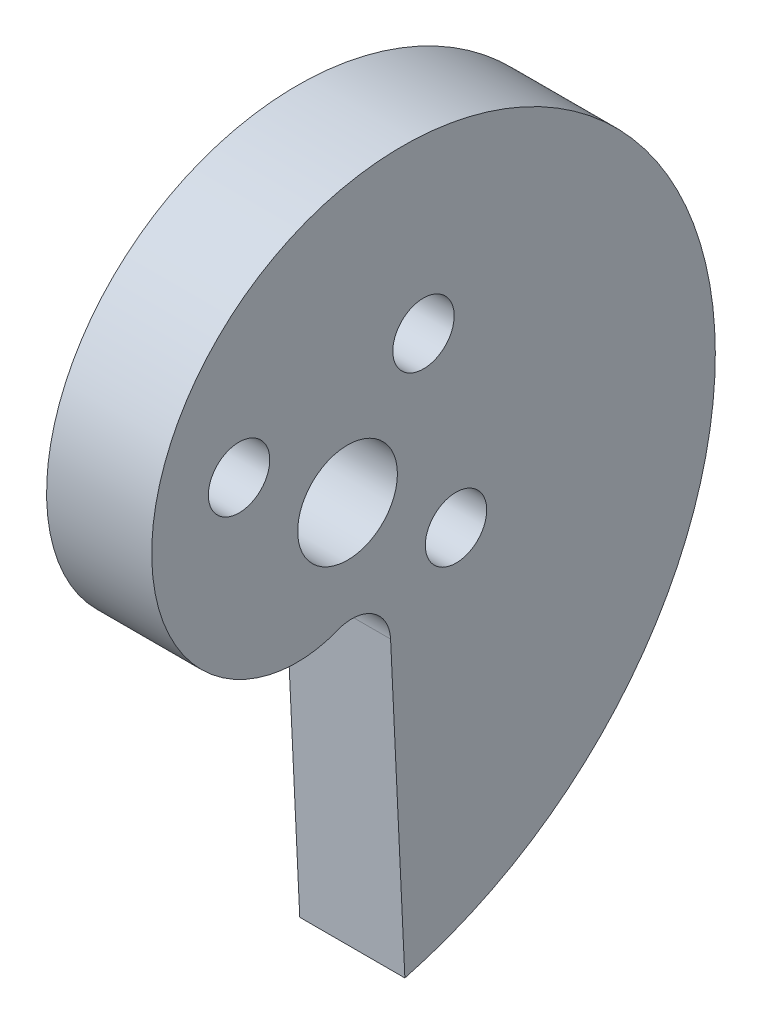
ISO-10303-21;
HEADER;
FILE_DESCRIPTION(('STEP AP214'),'2;1');
FILE_NAME('part.step','',(''),(''),'','','');
FILE_SCHEMA(('AUTOMOTIVE_DESIGN { 1 0 10303 214 1 1 1 1 }'));
ENDSEC;
DATA;
#1=APPLICATION_CONTEXT('core data for automotive mechanical design processes');
#2=APPLICATION_PROTOCOL_DEFINITION('international standard','automotive_design',2000,#1);
#3=PRODUCT_CONTEXT('',#1,'mechanical');
#4=PRODUCT('Part','Part','',(#3));
#5=PRODUCT_RELATED_PRODUCT_CATEGORY('part','',(#4));
#6=PRODUCT_DEFINITION_FORMATION('','',#4);
#7=PRODUCT_DEFINITION_CONTEXT('part definition',#1,'design');
#8=PRODUCT_DEFINITION('design','',#6,#7);
#9=PRODUCT_DEFINITION_SHAPE('','',#8);
#10=(LENGTH_UNIT() NAMED_UNIT(*) SI_UNIT(.MILLI.,.METRE.));
#11=(NAMED_UNIT(*) PLANE_ANGLE_UNIT() SI_UNIT($,.RADIAN.));
#12=(NAMED_UNIT(*) SI_UNIT($,.STERADIAN.) SOLID_ANGLE_UNIT());
#13=UNCERTAINTY_MEASURE_WITH_UNIT(LENGTH_MEASURE(1.E-05),#10,'distance_accuracy_value','');
#14=(GEOMETRIC_REPRESENTATION_CONTEXT(3) GLOBAL_UNCERTAINTY_ASSIGNED_CONTEXT((#13)) GLOBAL_UNIT_ASSIGNED_CONTEXT((#10,
#11,#12)) REPRESENTATION_CONTEXT('',''));
#15=CARTESIAN_POINT('',(0.,0.,0.));
#16=DIRECTION('',(0.,0.,1.));
#17=DIRECTION('',(1.,0.,0.));
#18=AXIS2_PLACEMENT_3D('',#15,#16,#17);
#19=CARTESIAN_POINT('',(6.35,16.3980040897592,0.208936694079273));
#20=DIRECTION('',(1.,0.,0.));
#21=DIRECTION('',(0.,0.,-1.));
#22=AXIS2_PLACEMENT_3D('',#19,#20,#21);
#23=PLANE('',#22);
#24=CARTESIAN_POINT('',(6.35,6.55321635431194,-4.58861149080837));
#25=DIRECTION('',(-1.,0.,0.));
#26=DIRECTION('',(0.,0.,1.));
#27=AXIS2_PLACEMENT_3D('',#24,#25,#26);
#28=CIRCLE('',#27,1.8542);
#29=CARTESIAN_POINT('',(6.35,6.55321635431194,-2.73441149080837));
#30=VERTEX_POINT('',#29);
#31=EDGE_CURVE('E151',#30,#30,#28,.T.);
#32=ORIENTED_EDGE('',*,*,#31,.T.);
#33=EDGE_LOOP('',(#32));
#34=FACE_BOUND('',#33,.T.);
#35=CARTESIAN_POINT('',(6.35,4.58861149080839,6.55321635431194));
#36=DIRECTION('',(-1.,0.,0.));
#37=DIRECTION('',(0.,0.,1.));
#38=AXIS2_PLACEMENT_3D('',#35,#36,#37);
#39=CIRCLE('',#38,1.8542);
#40=CARTESIAN_POINT('',(6.35,4.58861149080839,8.40741635431194));
#41=VERTEX_POINT('',#40);
#42=EDGE_CURVE('E155',#41,#41,#39,.T.);
#43=ORIENTED_EDGE('',*,*,#42,.T.);
#44=EDGE_LOOP('',(#43));
#45=FACE_BOUND('',#44,.T.);
#46=CARTESIAN_POINT('',(6.35,-4.58861149080837,-6.55321635431192));
#47=DIRECTION('',(-1.,0.,0.));
#48=DIRECTION('',(0.,0.,1.));
#49=AXIS2_PLACEMENT_3D('',#46,#47,#48);
#50=CIRCLE('',#49,1.8542);
#51=CARTESIAN_POINT('',(6.35,-4.58861149080837,-4.69901635431192));
#52=VERTEX_POINT('',#51);
#53=EDGE_CURVE('E158',#52,#52,#50,.T.);
#54=ORIENTED_EDGE('',*,*,#53,.T.);
#55=EDGE_LOOP('',(#54));
#56=FACE_BOUND('',#55,.T.);
#57=CARTESIAN_POINT('',(6.35,-26.6041786448891,-3.46411616806894));
#58=CARTESIAN_POINT('',(6.35,-26.5960990181453,-3.49393067135354));
#59=CARTESIAN_POINT('',(6.35,-26.5880156349324,-3.52374410868873));
#60=CARTESIAN_POINT('',(6.35,-26.5718488325451,-3.58337111594988));
#61=CARTESIAN_POINT('',(6.35,-26.5637654133707,-3.61318468587584));
#62=CARTESIAN_POINT('',(6.35,-26.5395261439436,-3.70262963202641));
#63=CARTESIAN_POINT('',(6.35,-26.5233815637382,-3.76226420628094));
#64=CARTESIAN_POINT('',(6.35,-26.4906236526863,-3.88140637873935));
#65=CARTESIAN_POINT('',(6.35,-26.4740103112024,-3.94091397402874));
#66=CARTESIAN_POINT('',(6.35,-26.4403815894244,-4.05981460436438));
#67=CARTESIAN_POINT('',(6.35,-26.4233662121929,-4.11920764027957));
#68=CARTESIAN_POINT('',(6.35,-26.3716923994657,-4.29720938115184));
#69=CARTESIAN_POINT('',(6.35,-26.3364072843143,-4.41563707917067));
#70=CARTESIAN_POINT('',(6.35,-26.2641853845529,-4.6519850599258));
#71=CARTESIAN_POINT('',(6.35,-26.2272486119225,-4.76990534633561));
#72=CARTESIAN_POINT('',(6.35,-26.1139444068046,-5.12293103285834));
#73=CARTESIAN_POINT('',(6.35,-26.0350986002427,-5.35724781947172));
#74=CARTESIAN_POINT('',(6.35,-25.8708563849999,-5.8235592949556));
#75=CARTESIAN_POINT('',(6.35,-25.7854600420231,-6.05555400709093));
#76=CARTESIAN_POINT('',(6.35,-25.5195003139906,-6.74780898379338));
#77=CARTESIAN_POINT('',(6.35,-25.3291595386374,-7.20436094526831));
#78=CARTESIAN_POINT('',(6.35,-24.9225212871115,-8.10647878886224));
#79=CARTESIAN_POINT('',(6.35,-24.7061887301483,-8.55202882213988));
#80=CARTESIAN_POINT('',(6.35,-24.2482870811777,-9.42992884621023));
#81=CARTESIAN_POINT('',(6.35,-24.0067199993427,-9.86227988488946));
#82=CARTESIAN_POINT('',(6.35,-23.499035484093,-10.7123263424163));
#83=CARTESIAN_POINT('',(6.35,-23.2329186005125,-11.1300220892049));
#84=CARTESIAN_POINT('',(6.35,-22.7456402479494,-11.847851602567));
#85=CARTESIAN_POINT('',(6.35,-22.5296437628228,-12.1515056315926));
#86=CARTESIAN_POINT('',(6.35,-22.084413352748,-12.7489932481006));
#87=CARTESIAN_POINT('',(6.35,-21.8551785466971,-13.0428261798607));
#88=CARTESIAN_POINT('',(6.35,-21.3838895241104,-13.620035602395));
#89=CARTESIAN_POINT('',(6.35,-21.141834989919,-13.9034118337705));
#90=CARTESIAN_POINT('',(6.35,-20.6453436861472,-14.4590921821359));
#91=CARTESIAN_POINT('',(6.35,-20.3909071208197,-14.7313964816312));
#92=CARTESIAN_POINT('',(6.35,-19.870311136869,-15.2640889646824));
#93=CARTESIAN_POINT('',(6.35,-19.6041625900917,-15.5244877601765));
#94=CARTESIAN_POINT('',(6.35,-19.0603866610495,-16.0329689554833));
#95=CARTESIAN_POINT('',(6.35,-18.7827592318886,-16.2810513049693));
#96=CARTESIAN_POINT('',(6.35,-17.933432481453,-17.0059312611249));
#97=CARTESIAN_POINT('',(6.35,-17.3451183982972,-17.4635361757599));
#98=CARTESIAN_POINT('',(6.35,-16.1647015449857,-18.2976613403723));
#99=CARTESIAN_POINT('',(6.35,-15.5748340735074,-18.6773591195821));
#100=CARTESIAN_POINT('',(6.35,-14.3640301688315,-19.3835613476243));
#101=CARTESIAN_POINT('',(6.35,-13.7430946848625,-19.7100674203402));
#102=CARTESIAN_POINT('',(6.35,-12.4747331278291,-20.3069368781326));
#103=CARTESIAN_POINT('',(6.35,-11.8273052792346,-20.5772964928467));
#104=CARTESIAN_POINT('',(6.35,-10.5107649849682,-21.0586719994844));
#105=CARTESIAN_POINT('',(6.35,-9.84165333182641,-21.2696900575841));
#106=CARTESIAN_POINT('',(6.35,-8.51931603069606,-21.6215571855532));
#107=CARTESIAN_POINT('',(6.35,-7.86685786047716,-21.7652761257472));
#108=CARTESIAN_POINT('',(6.35,-6.88075589921008,-21.9374607449297));
#109=CARTESIAN_POINT('',(6.35,-6.55078378350999,-21.9876263623933));
#110=CARTESIAN_POINT('',(6.35,-5.88895381514913,-22.0733163220885));
#111=CARTESIAN_POINT('',(6.35,-5.55709595067515,-22.1088405724972));
#112=CARTESIAN_POINT('',(6.35,-4.55979382082403,-22.1932365925857));
#113=CARTESIAN_POINT('',(6.35,-3.89228024143644,-22.2199912172447));
#114=CARTESIAN_POINT('',(6.35,-2.89152295014816,-22.2149934639596));
#115=CARTESIAN_POINT('',(6.35,-2.55798556615433,-22.2058023918767));
#116=CARTESIAN_POINT('',(6.35,-1.89167446294591,-22.1722723503277));
#117=CARTESIAN_POINT('',(6.35,-1.55890073697784,-22.1479335153446));
#118=CARTESIAN_POINT('',(6.35,-0.595715786563489,-22.0553379817985));
#119=CARTESIAN_POINT('',(6.35,0.0329519082644807,-21.9672696384117));
#120=CARTESIAN_POINT('',(6.35,0.968090394017084,-21.7940847068843));
#121=CARTESIAN_POINT('',(6.35,1.27852595277456,-21.7295000942686));
#122=CARTESIAN_POINT('',(6.35,1.89622303880414,-21.5866153495594));
#123=CARTESIAN_POINT('',(6.35,2.20348455851135,-21.5083151847848));
#124=CARTESIAN_POINT('',(6.35,3.11949232688065,-21.2529876735919));
#125=CARTESIAN_POINT('',(6.35,3.72272393447467,-21.0554848603221));
#126=CARTESIAN_POINT('',(6.35,4.61211008989112,-20.7191477551366));
#127=CARTESIAN_POINT('',(6.35,4.90602590174425,-20.600340041007));
#128=CARTESIAN_POINT('',(6.35,5.48814338740102,-20.3494332944114));
#129=CARTESIAN_POINT('',(6.35,5.77634502116379,-20.2173341688482));
#130=CARTESIAN_POINT('',(6.35,6.60155511822596,-19.8159032003133));
#131=CARTESIAN_POINT('',(6.35,7.13040589307388,-19.5295564938876));
#132=CARTESIAN_POINT('',(6.35,8.16081793802565,-18.9114937344462));
#133=CARTESIAN_POINT('',(6.35,8.66238000700598,-18.5797790105786));
#134=CARTESIAN_POINT('',(6.35,9.63370323518806,-17.8727976579963));
#135=CARTESIAN_POINT('',(6.35,10.1034706650373,-17.4975396568974));
#136=CARTESIAN_POINT('',(6.35,11.0071094740781,-16.7060538785788));
#137=CARTESIAN_POINT('',(6.35,11.4409836517707,-16.2898293009652));
#138=CARTESIAN_POINT('',(6.35,12.2455901724637,-15.4431512610323));
#139=CARTESIAN_POINT('',(6.35,12.6184856964032,-15.0147506322602));
#140=CARTESIAN_POINT('',(6.35,13.3251088370727,-14.1266556784948));
#141=CARTESIAN_POINT('',(6.35,13.658837644674,-13.6669623056353));
#142=CARTESIAN_POINT('',(6.35,14.1273347711691,-12.9565066966575));
#143=CARTESIAN_POINT('',(6.35,14.2781567865579,-12.7161917146737));
#144=CARTESIAN_POINT('',(6.35,14.5687526701808,-12.2289769415579));
#145=CARTESIAN_POINT('',(6.35,14.7085275622432,-11.982077763481));
#146=CARTESIAN_POINT('',(6.35,14.976662087067,-11.4822081934086));
#147=CARTESIAN_POINT('',(6.35,15.1050233906383,-11.2292386969412));
#148=CARTESIAN_POINT('',(6.35,15.3500337253178,-10.7175936099666));
#149=CARTESIAN_POINT('',(6.35,15.4666792251924,-10.4589163275719));
#150=CARTESIAN_POINT('',(6.35,15.6813212851905,-9.95180679999024));
#151=CARTESIAN_POINT('',(6.35,15.7800115945683,-9.70366850500394));
#152=CARTESIAN_POINT('',(6.35,15.9663531695722,-9.2032821883138));
#153=CARTESIAN_POINT('',(6.35,16.0540033918904,-8.95103378073715));
#154=CARTESIAN_POINT('',(6.35,16.3000334282841,-8.18886243094257));
#155=CARTESIAN_POINT('',(6.35,16.4415695943575,-7.67333168162063));
#156=CARTESIAN_POINT('',(6.35,16.6185812659381,-6.89232214687901));
#157=CARTESIAN_POINT('',(6.35,16.6717037530089,-6.63069488211353));
#158=CARTESIAN_POINT('',(6.35,16.7659669980484,-6.10528997868587));
#159=CARTESIAN_POINT('',(6.35,16.8071076371406,-5.84151231871546));
#160=CARTESIAN_POINT('',(6.35,16.9123052056012,-5.04776388346588));
#161=CARTESIAN_POINT('',(6.35,16.9581756794004,-4.5152108565262));
#162=CARTESIAN_POINT('',(6.35,16.9889866131176,-3.73188497077908));
#163=CARTESIAN_POINT('',(6.35,16.9933497523758,-3.48170479371437));
#164=CARTESIAN_POINT('',(6.35,16.9910077767209,-2.98139125909959));
#165=CARTESIAN_POINT('',(6.35,16.9843028337307,-2.73125790088262));
#166=CARTESIAN_POINT('',(6.35,16.9474771512814,-1.98170896838924));
#167=CARTESIAN_POINT('',(6.35,16.9006509706288,-1.48300889884048));
#168=CARTESIAN_POINT('',(6.35,16.7621449217171,-0.492050969980706));
#169=CARTESIAN_POINT('',(6.35,16.6704764254929,0.00020849019213582));
#170=CARTESIAN_POINT('',(6.35,16.4420525322467,0.974178631913562));
#171=CARTESIAN_POINT('',(6.35,16.3052998467292,1.45588994600308));
#172=CARTESIAN_POINT('',(6.35,15.9979016234245,2.37265974437791));
#173=CARTESIAN_POINT('',(6.35,15.8301329655558,2.80868423790338));
#174=CARTESIAN_POINT('',(6.35,15.4562265829443,3.66397859957526));
#175=CARTESIAN_POINT('',(6.35,15.2500901712971,4.08324904051499));
#176=CARTESIAN_POINT('',(6.35,14.8006581322923,4.90125114980656));
#177=CARTESIAN_POINT('',(6.35,14.5573729209783,5.29998853358491));
#178=CARTESIAN_POINT('',(6.35,14.0347805079883,6.07310185409697));
#179=CARTESIAN_POINT('',(6.35,13.7554758700731,6.44747952183559));
#180=CARTESIAN_POINT('',(6.35,13.1839183924489,7.14235925341812));
#181=CARTESIAN_POINT('',(6.35,12.8940275022432,7.46479955466107));
#182=CARTESIAN_POINT('',(6.35,12.4384424571224,7.92791034063023));
#183=CARTESIAN_POINT('',(6.35,12.2831032441109,8.07887213844365));
#184=CARTESIAN_POINT('',(6.35,11.9657286963515,8.37357323403963));
#185=CARTESIAN_POINT('',(6.35,11.8036933306129,8.51731249838838));
#186=CARTESIAN_POINT('',(6.35,11.3080343569058,8.93710093457745));
#187=CARTESIAN_POINT('',(6.35,10.9646916643919,9.20188991072441));
#188=CARTESIAN_POINT('',(6.35,10.4324327389453,9.57404235832414));
#189=CARTESIAN_POINT('',(6.35,10.2521216010789,9.69393119674056));
#190=CARTESIAN_POINT('',(6.35,9.88598424193469,9.92497549292142));
#191=CARTESIAN_POINT('',(6.35,9.70015816748061,10.0361311829009));
#192=CARTESIAN_POINT('',(6.35,9.16444116405589,10.3393060660077));
#193=CARTESIAN_POINT('',(6.35,8.80832915226598,10.5204801836729));
#194=CARTESIAN_POINT('',(6.35,8.08132908197637,10.8501433844362));
#195=CARTESIAN_POINT('',(6.35,7.71044060320731,10.9986315371016));
#196=CARTESIAN_POINT('',(6.35,6.95664104338392,11.2610276657326));
#197=CARTESIAN_POINT('',(6.35,6.57373373578024,11.3749463776861));
#198=CARTESIAN_POINT('',(6.35,5.99273470026,11.5183452851603));
#199=CARTESIAN_POINT('',(6.35,5.7979496332391,11.5615669025186));
#200=CARTESIAN_POINT('',(6.35,5.40652321008225,11.6385618313836));
#201=CARTESIAN_POINT('',(6.35,5.20988190770239,11.6723354156404));
#202=CARTESIAN_POINT('',(6.35,4.65033370171099,11.7544105230111));
#203=CARTESIAN_POINT('',(6.35,4.28568497206795,11.7912985181493));
#204=CARTESIAN_POINT('',(6.35,3.55455013605828,11.8318701835188));
#205=CARTESIAN_POINT('',(6.35,3.18806390085958,11.8355514920303));
#206=CARTESIAN_POINT('',(6.35,2.45641583932739,11.8090174666788));
#207=CARTESIAN_POINT('',(6.35,2.09125359671678,11.778813920978));
#208=CARTESIAN_POINT('',(6.35,1.36548059192559,11.6838082483825));
#209=CARTESIAN_POINT('',(6.35,1.00486887674723,11.6190134931392));
#210=CARTESIAN_POINT('',(6.35,0.324307942849594,11.4614382628748));
#211=CARTESIAN_POINT('',(6.35,0.00364406995611465,11.3717401093354));
#212=CARTESIAN_POINT('',(6.35,-0.628147099321365,11.1632867552544));
#213=CARTESIAN_POINT('',(6.35,-0.939273778376596,11.044529678221));
#214=CARTESIAN_POINT('',(6.35,-1.54892201894779,10.7784921512198));
#215=CARTESIAN_POINT('',(6.35,-1.84744907693349,10.6312242987931));
#216=CARTESIAN_POINT('',(6.35,-2.42897758776261,10.3086185913174));
#217=CARTESIAN_POINT('',(6.35,-2.71198222110295,10.1332865156067));
#218=CARTESIAN_POINT('',(6.35,-3.10837977647508,9.85924255327324));
#219=CARTESIAN_POINT('',(6.35,-3.22942542142978,9.77144787341416));
#220=CARTESIAN_POINT('',(6.35,-3.46732952151261,9.59036048217526));
#221=CARTESIAN_POINT('',(6.35,-3.58418806355643,9.4970678850274));
#222=CARTESIAN_POINT('',(6.35,-3.92806004067557,9.20918027089204));
#223=CARTESIAN_POINT('',(6.35,-4.14842759657389,9.00653556116692));
#224=CARTESIAN_POINT('',(6.35,-4.56878919503829,8.58138333255455));
#225=CARTESIAN_POINT('',(6.35,-4.76879483064123,8.35888725296908));
#226=CARTESIAN_POINT('',(6.35,-5.14614206186432,7.89543066389403));
#227=CARTESIAN_POINT('',(6.35,-5.3234875023102,7.65447329791619));
#228=CARTESIAN_POINT('',(6.35,-5.63430947780914,7.18366218799663));
#229=CARTESIAN_POINT('',(6.35,-5.77047423090025,6.95558248768723));
#230=CARTESIAN_POINT('',(6.35,-6.02062257579595,6.48754083821427));
#231=CARTESIAN_POINT('',(6.35,-6.1346071224693,6.24757940112347));
#232=CARTESIAN_POINT('',(6.35,-6.33887912149973,5.75777155134351));
#233=CARTESIAN_POINT('',(6.35,-6.42916767621237,5.50792559911196));
#234=CARTESIAN_POINT('',(6.35,-6.58443349235139,5.00049357965073));
#235=CARTESIAN_POINT('',(6.35,-6.64941442335705,4.74290864040478));
#236=CARTESIAN_POINT('',(6.35,-6.74598736460804,4.25449797920384));
#237=CARTESIAN_POINT('',(6.35,-6.780711824222,4.02429629283166));
#238=CARTESIAN_POINT('',(6.35,-6.81617319998053,3.67733736076881));
#239=CARTESIAN_POINT('',(6.35,-6.82522288289698,3.56139077828091));
#240=CARTESIAN_POINT('',(6.35,-6.83763420983804,3.32919441165276));
#241=CARTESIAN_POINT('',(6.35,-6.84099580829413,3.21294462509094));
#242=CARTESIAN_POINT('',(6.35,-6.84242850832694,2.86488965539435));
#243=CARTESIAN_POINT('',(6.35,-6.83192934168472,2.6329862272909));
#244=CARTESIAN_POINT('',(6.35,-6.78738287473666,2.17159674221351));
#245=CARTESIAN_POINT('',(6.35,-6.75335040877215,1.94210925480276));
#246=CARTESIAN_POINT('',(6.35,-6.66928060603601,1.52806566622524));
#247=CARTESIAN_POINT('',(6.35,-6.62312313736352,1.34272156396831));
#248=CARTESIAN_POINT('',(6.35,-6.51402688183936,0.977073180265552));
#249=CARTESIAN_POINT('',(6.35,-6.45108967798272,0.796768425181119));
#250=CARTESIAN_POINT('',(6.35,-6.37955418312461,0.619822850888123));
#251=B_SPLINE_CURVE_WITH_KNOTS('',3,(#57,#58,#59,#60,#61,#62,#63,#64,#65,#66,#67,#68,#69,#70,
#71,#72,#73,#74,#75,#76,#77,#78,#79,#80,#81,#82,#83,#84,#85,#86,#87,#88,#89,#90,#91,#92,#93,#94,
#95,#96,#97,#98,#99,#100,#101,#102,#103,#104,#105,#106,#107,#108,#109,#110,#111,#112,#113,#114,
#115,#116,#117,#118,#119,#120,#121,#122,#123,#124,#125,#126,#127,#128,#129,#130,#131,#132,#133,
#134,#135,#136,#137,#138,#139,#140,#141,#142,#143,#144,#145,#146,#147,#148,#149,#150,#151,#152,
#153,#154,#155,#156,#157,#158,#159,#160,#161,#162,#163,#164,#165,#166,#167,#168,#169,#170,#171,
#172,#173,#174,#175,#176,#177,#178,#179,#180,#181,#182,#183,#184,#185,#186,#187,#188,#189,#190,
#191,#192,#193,#194,#195,#196,#197,#198,#199,#200,#201,#202,#203,#204,#205,#206,#207,#208,#209,
#210,#211,#212,#213,#214,#215,#216,#217,#218,#219,#220,#221,#222,#223,#224,#225,#226,#227,#228,
#229,#230,#231,#232,#233,#234,#235,#236,#237,#238,#239,#240,#241,#242,#243,#244,#245,#246,#247,
#248,#249,#250),.UNSPECIFIED.,.F.,.F.,(4,2,2,2,2,2,2,2,2,2,2,2,2,2,2,2,2,2,2,2,2,2,2,2,2,2,2,2,
2,2,2,2,2,2,2,2,2,2,2,2,2,2,2,2,2,2,2,2,2,2,2,2,2,2,2,2,2,2,2,2,2,2,2,2,2,2,2,2,2,2,2,2,2,2,2,2,
2,2,2,2,2,2,2,2,2,2,2,2,2,2,2,2,2,2,2,2,4),(0.,0.0926695617352574,0.185339535614265,
0.370682711215113,0.556030096112552,0.741376069577325,1.1120793414309,1.48277992497415,
2.2243479758606,2.96590858953527,4.44896419863202,5.93404444342148,7.41900647738353,
8.90393526118761,10.0215131922545,11.1391655918504,12.2568456983469,13.3745073739483,
14.4911525872986,15.6078023630403,17.8403733209062,19.942329574827,22.0442216463401,
24.1462548190774,26.2482112502258,28.2497809593054,29.2507798930136,30.2517851043673,
32.2527611602103,33.2534722057809,34.2541743670945,36.1557427204534,37.1067331856918,
38.0577259169634,39.9589143278495,40.9097121227251,41.8605165777567,43.6622308050559,
45.4638922587852,47.265197340965,49.0663618475696,50.7681276305578,52.4698416576219,
53.3207700719231,54.1716195309475,55.0223442302499,55.8733245798795,56.6741831513156,
57.475117348612,59.0763957503357,59.8770662248953,60.6777446429507,62.2785901719909,
63.0290553534382,63.7795088778617,65.2800101467939,66.7801310849274,68.2801618175425,
69.6799153349475,71.0796209560827,72.4789348360549,73.8781491717417,75.1771008636637,
75.8267289281718,76.4763599995956,77.7749132133461,78.4243090869169,79.0736876871546,
80.2706163235864,81.4675790271636,82.6641696171176,83.2625396804237,83.860892467929,
84.9588208120137,86.0568272421415,87.154451806521,88.2518425520269,89.2493967940745,
90.2470154706009,91.2441943493013,92.24116813994,92.6896317930356,93.1380861315428,
94.0347850469901,94.9309705386994,95.8270037693383,96.622784174215,97.418530312772,
98.2142394260493,99.009833119334,99.7071699333863,100.055943118078,100.404719096858,
101.099890942744,101.794624982317,102.366866921723,102.939054895092),.UNSPECIFIED.);
#252=CARTESIAN_POINT('',(6.35,-26.6041786448891,-3.46411616806894));
#253=VERTEX_POINT('',#252);
#254=CARTESIAN_POINT('',(6.35,-6.37955418312461,0.619822850888123));
#255=VERTEX_POINT('',#254);
#256=EDGE_CURVE('E130',#253,#255,#251,.T.);
#257=ORIENTED_EDGE('',*,*,#256,.T.);
#258=CARTESIAN_POINT('',(6.35,-8.55278837318837,-0.259188983321581));
#259=DIRECTION('',(1.,0.,0.));
#260=DIRECTION('',(0.,0.,-1.));
#261=AXIS2_PLACEMENT_3D('',#258,#259,#260);
#262=CIRCLE('',#261,2.34427145389411);
#263=CARTESIAN_POINT('',(6.35,-8.44148736532646,-2.60081677936256));
#264=VERTEX_POINT('',#263);
#265=EDGE_CURVE('E52',#255,#264,#262,.F.);
#266=ORIENTED_EDGE('',*,*,#265,.T.);
#267=DIRECTION('',(0.,-0.998872290216758,-0.0474778668131734));
#268=VECTOR('',#267,1.);
#269=CARTESIAN_POINT('',(6.35,-26.3357339713737,-3.45135659852166));
#270=LINE('',#269,#268);
#271=EDGE_CURVE('E66',#264,#253,#270,.T.);
#272=ORIENTED_EDGE('',*,*,#271,.T.);
#273=EDGE_LOOP('',(#257,#266,#272));
#274=FACE_BOUND('',#273,.T.);
#275=CARTESIAN_POINT('',(6.35,0.,0.));
#276=DIRECTION('',(1.,0.,0.));
#277=DIRECTION('',(0.,0.,-1.));
#278=AXIS2_PLACEMENT_3D('',#275,#276,#277);
#279=CIRCLE('',#278,3.012699969);
#280=CARTESIAN_POINT('',(6.35,0.,-3.012699969));
#281=VERTEX_POINT('',#280);
#282=EDGE_CURVE('E99',#281,#281,#279,.T.);
#283=ORIENTED_EDGE('',*,*,#282,.F.);
#284=EDGE_LOOP('',(#283));
#285=FACE_BOUND('',#284,.T.);
#286=ADVANCED_FACE('F48',(#34,#45,#56,#274,#285),#23,.T.);
#287=CARTESIAN_POINT('',(0.,16.3980040897592,0.208936694079273));
#288=DIRECTION('',(1.,0.,0.));
#289=DIRECTION('',(0.,0.,-1.));
#290=AXIS2_PLACEMENT_3D('',#287,#288,#289);
#291=PLANE('',#290);
#292=CARTESIAN_POINT('',(0.,6.55321635431194,-4.58861149080837));
#293=DIRECTION('',(-1.,0.,0.));
#294=DIRECTION('',(0.,0.,1.));
#295=AXIS2_PLACEMENT_3D('',#292,#293,#294);
#296=CIRCLE('',#295,1.8542);
#297=CARTESIAN_POINT('',(0.,6.55321635431194,-2.73441149080837));
#298=VERTEX_POINT('',#297);
#299=EDGE_CURVE('E170',#298,#298,#296,.T.);
#300=ORIENTED_EDGE('',*,*,#299,.F.);
#301=EDGE_LOOP('',(#300));
#302=FACE_BOUND('',#301,.T.);
#303=CARTESIAN_POINT('',(0.,4.58861149080839,6.55321635431194));
#304=DIRECTION('',(-1.,0.,0.));
#305=DIRECTION('',(0.,0.,1.));
#306=AXIS2_PLACEMENT_3D('',#303,#304,#305);
#307=CIRCLE('',#306,1.8542);
#308=CARTESIAN_POINT('',(0.,4.58861149080839,8.40741635431194));
#309=VERTEX_POINT('',#308);
#310=EDGE_CURVE('E166',#309,#309,#307,.T.);
#311=ORIENTED_EDGE('',*,*,#310,.F.);
#312=EDGE_LOOP('',(#311));
#313=FACE_BOUND('',#312,.T.);
#314=CARTESIAN_POINT('',(0.,-4.58861149080837,-6.55321635431192));
#315=DIRECTION('',(-1.,0.,0.));
#316=DIRECTION('',(0.,0.,1.));
#317=AXIS2_PLACEMENT_3D('',#314,#315,#316);
#318=CIRCLE('',#317,1.8542);
#319=CARTESIAN_POINT('',(0.,-4.58861149080837,-4.69901635431192));
#320=VERTEX_POINT('',#319);
#321=EDGE_CURVE('E160',#320,#320,#318,.T.);
#322=ORIENTED_EDGE('',*,*,#321,.F.);
#323=EDGE_LOOP('',(#322));
#324=FACE_BOUND('',#323,.T.);
#325=CARTESIAN_POINT('',(0.,-26.6041786448891,-3.46411616806894));
#326=CARTESIAN_POINT('',(0.,-26.5960990181453,-3.49393067135354));
#327=CARTESIAN_POINT('',(0.,-26.5880156349324,-3.52374410868873));
#328=CARTESIAN_POINT('',(0.,-26.5718488325451,-3.58337111594988));
#329=CARTESIAN_POINT('',(0.,-26.5637654133707,-3.61318468587584));
#330=CARTESIAN_POINT('',(0.,-26.5395261439436,-3.70262963202641));
#331=CARTESIAN_POINT('',(0.,-26.5233815637382,-3.76226420628094));
#332=CARTESIAN_POINT('',(0.,-26.4906236526863,-3.88140637873935));
#333=CARTESIAN_POINT('',(0.,-26.4740103112024,-3.94091397402874));
#334=CARTESIAN_POINT('',(0.,-26.4403815894244,-4.05981460436438));
#335=CARTESIAN_POINT('',(0.,-26.4233662121929,-4.11920764027957));
#336=CARTESIAN_POINT('',(0.,-26.3716923994657,-4.29720938115184));
#337=CARTESIAN_POINT('',(0.,-26.3364072843143,-4.41563707917067));
#338=CARTESIAN_POINT('',(0.,-26.2641853845529,-4.6519850599258));
#339=CARTESIAN_POINT('',(0.,-26.2272486119225,-4.76990534633561));
#340=CARTESIAN_POINT('',(0.,-26.1139444068046,-5.12293103285834));
#341=CARTESIAN_POINT('',(0.,-26.0350986002427,-5.35724781947172));
#342=CARTESIAN_POINT('',(0.,-25.8708563849999,-5.8235592949556));
#343=CARTESIAN_POINT('',(0.,-25.7854600420231,-6.05555400709093));
#344=CARTESIAN_POINT('',(0.,-25.5195003139906,-6.74780898379338));
#345=CARTESIAN_POINT('',(0.,-25.3291595386374,-7.20436094526831));
#346=CARTESIAN_POINT('',(0.,-24.9225212871115,-8.10647878886224));
#347=CARTESIAN_POINT('',(0.,-24.7061887301483,-8.55202882213988));
#348=CARTESIAN_POINT('',(0.,-24.2482870811777,-9.42992884621023));
#349=CARTESIAN_POINT('',(0.,-24.0067199993427,-9.86227988488946));
#350=CARTESIAN_POINT('',(0.,-23.499035484093,-10.7123263424163));
#351=CARTESIAN_POINT('',(0.,-23.2329186005125,-11.1300220892049));
#352=CARTESIAN_POINT('',(0.,-22.7456402479494,-11.847851602567));
#353=CARTESIAN_POINT('',(0.,-22.5296437628228,-12.1515056315926));
#354=CARTESIAN_POINT('',(0.,-22.084413352748,-12.7489932481006));
#355=CARTESIAN_POINT('',(0.,-21.8551785466971,-13.0428261798607));
#356=CARTESIAN_POINT('',(0.,-21.3838895241104,-13.620035602395));
#357=CARTESIAN_POINT('',(0.,-21.141834989919,-13.9034118337705));
#358=CARTESIAN_POINT('',(0.,-20.6453436861472,-14.4590921821359));
#359=CARTESIAN_POINT('',(0.,-20.3909071208197,-14.7313964816312));
#360=CARTESIAN_POINT('',(0.,-19.870311136869,-15.2640889646824));
#361=CARTESIAN_POINT('',(0.,-19.6041625900917,-15.5244877601765));
#362=CARTESIAN_POINT('',(0.,-19.0603866610495,-16.0329689554833));
#363=CARTESIAN_POINT('',(0.,-18.7827592318886,-16.2810513049693));
#364=CARTESIAN_POINT('',(0.,-17.933432481453,-17.0059312611249));
#365=CARTESIAN_POINT('',(0.,-17.3451183982972,-17.4635361757599));
#366=CARTESIAN_POINT('',(0.,-16.1647015449857,-18.2976613403723));
#367=CARTESIAN_POINT('',(0.,-15.5748340735074,-18.6773591195821));
#368=CARTESIAN_POINT('',(0.,-14.3640301688315,-19.3835613476243));
#369=CARTESIAN_POINT('',(0.,-13.7430946848625,-19.7100674203402));
#370=CARTESIAN_POINT('',(0.,-12.4747331278291,-20.3069368781326));
#371=CARTESIAN_POINT('',(0.,-11.8273052792346,-20.5772964928467));
#372=CARTESIAN_POINT('',(0.,-10.5107649849682,-21.0586719994844));
#373=CARTESIAN_POINT('',(0.,-9.84165333182641,-21.2696900575841));
#374=CARTESIAN_POINT('',(0.,-8.51931603069606,-21.6215571855532));
#375=CARTESIAN_POINT('',(0.,-7.86685786047716,-21.7652761257472));
#376=CARTESIAN_POINT('',(0.,-6.88075589921008,-21.9374607449297));
#377=CARTESIAN_POINT('',(0.,-6.55078378350999,-21.9876263623933));
#378=CARTESIAN_POINT('',(0.,-5.88895381514913,-22.0733163220885));
#379=CARTESIAN_POINT('',(0.,-5.55709595067515,-22.1088405724972));
#380=CARTESIAN_POINT('',(0.,-4.55979382082403,-22.1932365925857));
#381=CARTESIAN_POINT('',(0.,-3.89228024143644,-22.2199912172447));
#382=CARTESIAN_POINT('',(0.,-2.89152295014816,-22.2149934639596));
#383=CARTESIAN_POINT('',(0.,-2.55798556615433,-22.2058023918767));
#384=CARTESIAN_POINT('',(0.,-1.89167446294591,-22.1722723503277));
#385=CARTESIAN_POINT('',(0.,-1.55890073697784,-22.1479335153446));
#386=CARTESIAN_POINT('',(0.,-0.595715786563489,-22.0553379817985));
#387=CARTESIAN_POINT('',(0.,0.0329519082644807,-21.9672696384117));
#388=CARTESIAN_POINT('',(0.,0.968090394017084,-21.7940847068843));
#389=CARTESIAN_POINT('',(0.,1.27852595277456,-21.7295000942686));
#390=CARTESIAN_POINT('',(0.,1.89622303880414,-21.5866153495594));
#391=CARTESIAN_POINT('',(0.,2.20348455851135,-21.5083151847848));
#392=CARTESIAN_POINT('',(0.,3.11949232688065,-21.2529876735919));
#393=CARTESIAN_POINT('',(0.,3.72272393447467,-21.0554848603221));
#394=CARTESIAN_POINT('',(0.,4.61211008989112,-20.7191477551366));
#395=CARTESIAN_POINT('',(0.,4.90602590174425,-20.600340041007));
#396=CARTESIAN_POINT('',(0.,5.48814338740102,-20.3494332944114));
#397=CARTESIAN_POINT('',(0.,5.77634502116379,-20.2173341688482));
#398=CARTESIAN_POINT('',(0.,6.60155511822596,-19.8159032003133));
#399=CARTESIAN_POINT('',(0.,7.13040589307388,-19.5295564938876));
#400=CARTESIAN_POINT('',(0.,8.16081793802565,-18.9114937344462));
#401=CARTESIAN_POINT('',(0.,8.66238000700598,-18.5797790105786));
#402=CARTESIAN_POINT('',(0.,9.63370323518806,-17.8727976579963));
#403=CARTESIAN_POINT('',(0.,10.1034706650373,-17.4975396568974));
#404=CARTESIAN_POINT('',(0.,11.0071094740781,-16.7060538785788));
#405=CARTESIAN_POINT('',(0.,11.4409836517707,-16.2898293009652));
#406=CARTESIAN_POINT('',(0.,12.2455901724637,-15.4431512610323));
#407=CARTESIAN_POINT('',(0.,12.6184856964032,-15.0147506322602));
#408=CARTESIAN_POINT('',(0.,13.3251088370727,-14.1266556784948));
#409=CARTESIAN_POINT('',(0.,13.658837644674,-13.6669623056353));
#410=CARTESIAN_POINT('',(0.,14.1273347711691,-12.9565066966575));
#411=CARTESIAN_POINT('',(0.,14.2781567865579,-12.7161917146737));
#412=CARTESIAN_POINT('',(0.,14.5687526701808,-12.2289769415579));
#413=CARTESIAN_POINT('',(0.,14.7085275622432,-11.982077763481));
#414=CARTESIAN_POINT('',(0.,14.976662087067,-11.4822081934086));
#415=CARTESIAN_POINT('',(0.,15.1050233906383,-11.2292386969412));
#416=CARTESIAN_POINT('',(0.,15.3500337253178,-10.7175936099666));
#417=CARTESIAN_POINT('',(0.,15.4666792251924,-10.4589163275719));
#418=CARTESIAN_POINT('',(0.,15.6813212851905,-9.95180679999024));
#419=CARTESIAN_POINT('',(0.,15.7800115945683,-9.70366850500394));
#420=CARTESIAN_POINT('',(0.,15.9663531695722,-9.2032821883138));
#421=CARTESIAN_POINT('',(0.,16.0540033918904,-8.95103378073715));
#422=CARTESIAN_POINT('',(0.,16.3000334282841,-8.18886243094257));
#423=CARTESIAN_POINT('',(0.,16.4415695943575,-7.67333168162063));
#424=CARTESIAN_POINT('',(0.,16.6185812659381,-6.89232214687901));
#425=CARTESIAN_POINT('',(0.,16.6717037530089,-6.63069488211353));
#426=CARTESIAN_POINT('',(0.,16.7659669980484,-6.10528997868587));
#427=CARTESIAN_POINT('',(0.,16.8071076371406,-5.84151231871546));
#428=CARTESIAN_POINT('',(0.,16.9123052056012,-5.04776388346588));
#429=CARTESIAN_POINT('',(0.,16.9581756794004,-4.5152108565262));
#430=CARTESIAN_POINT('',(0.,16.9889866131176,-3.73188497077908));
#431=CARTESIAN_POINT('',(0.,16.9933497523758,-3.48170479371437));
#432=CARTESIAN_POINT('',(0.,16.9910077767209,-2.98139125909959));
#433=CARTESIAN_POINT('',(0.,16.9843028337307,-2.73125790088262));
#434=CARTESIAN_POINT('',(0.,16.9474771512814,-1.98170896838924));
#435=CARTESIAN_POINT('',(0.,16.9006509706288,-1.48300889884048));
#436=CARTESIAN_POINT('',(0.,16.7621449217171,-0.492050969980706));
#437=CARTESIAN_POINT('',(0.,16.6704764254929,0.00020849019213582));
#438=CARTESIAN_POINT('',(0.,16.4420525322467,0.974178631913562));
#439=CARTESIAN_POINT('',(0.,16.3052998467292,1.45588994600308));
#440=CARTESIAN_POINT('',(0.,15.9979016234245,2.37265974437791));
#441=CARTESIAN_POINT('',(0.,15.8301329655558,2.80868423790338));
#442=CARTESIAN_POINT('',(0.,15.4562265829443,3.66397859957526));
#443=CARTESIAN_POINT('',(0.,15.2500901712971,4.08324904051499));
#444=CARTESIAN_POINT('',(0.,14.8006581322923,4.90125114980656));
#445=CARTESIAN_POINT('',(0.,14.5573729209783,5.29998853358491));
#446=CARTESIAN_POINT('',(0.,14.0347805079883,6.07310185409697));
#447=CARTESIAN_POINT('',(0.,13.7554758700731,6.44747952183559));
#448=CARTESIAN_POINT('',(0.,13.1839183924489,7.14235925341812));
#449=CARTESIAN_POINT('',(0.,12.8940275022432,7.46479955466107));
#450=CARTESIAN_POINT('',(0.,12.4384424571224,7.92791034063023));
#451=CARTESIAN_POINT('',(0.,12.2831032441109,8.07887213844365));
#452=CARTESIAN_POINT('',(0.,11.9657286963515,8.37357323403963));
#453=CARTESIAN_POINT('',(0.,11.8036933306129,8.51731249838838));
#454=CARTESIAN_POINT('',(0.,11.3080343569058,8.93710093457745));
#455=CARTESIAN_POINT('',(0.,10.9646916643919,9.20188991072441));
#456=CARTESIAN_POINT('',(0.,10.4324327389453,9.57404235832414));
#457=CARTESIAN_POINT('',(0.,10.2521216010789,9.69393119674056));
#458=CARTESIAN_POINT('',(0.,9.88598424193469,9.92497549292142));
#459=CARTESIAN_POINT('',(0.,9.70015816748061,10.0361311829009));
#460=CARTESIAN_POINT('',(0.,9.16444116405589,10.3393060660077));
#461=CARTESIAN_POINT('',(0.,8.80832915226598,10.5204801836729));
#462=CARTESIAN_POINT('',(0.,8.08132908197637,10.8501433844362));
#463=CARTESIAN_POINT('',(0.,7.71044060320731,10.9986315371016));
#464=CARTESIAN_POINT('',(0.,6.95664104338392,11.2610276657326));
#465=CARTESIAN_POINT('',(0.,6.57373373578024,11.3749463776861));
#466=CARTESIAN_POINT('',(0.,5.99273470026,11.5183452851603));
#467=CARTESIAN_POINT('',(0.,5.7979496332391,11.5615669025186));
#468=CARTESIAN_POINT('',(0.,5.40652321008225,11.6385618313836));
#469=CARTESIAN_POINT('',(0.,5.20988190770239,11.6723354156404));
#470=CARTESIAN_POINT('',(0.,4.65033370171099,11.7544105230111));
#471=CARTESIAN_POINT('',(0.,4.28568497206795,11.7912985181493));
#472=CARTESIAN_POINT('',(0.,3.55455013605828,11.8318701835188));
#473=CARTESIAN_POINT('',(0.,3.18806390085958,11.8355514920303));
#474=CARTESIAN_POINT('',(0.,2.45641583932739,11.8090174666788));
#475=CARTESIAN_POINT('',(0.,2.09125359671678,11.778813920978));
#476=CARTESIAN_POINT('',(0.,1.36548059192559,11.6838082483825));
#477=CARTESIAN_POINT('',(0.,1.00486887674723,11.6190134931392));
#478=CARTESIAN_POINT('',(0.,0.324307942849594,11.4614382628748));
#479=CARTESIAN_POINT('',(0.,0.00364406995611465,11.3717401093354));
#480=CARTESIAN_POINT('',(0.,-0.628147099321365,11.1632867552544));
#481=CARTESIAN_POINT('',(0.,-0.939273778376596,11.044529678221));
#482=CARTESIAN_POINT('',(0.,-1.54892201894779,10.7784921512198));
#483=CARTESIAN_POINT('',(0.,-1.84744907693349,10.6312242987931));
#484=CARTESIAN_POINT('',(0.,-2.42897758776261,10.3086185913174));
#485=CARTESIAN_POINT('',(0.,-2.71198222110295,10.1332865156067));
#486=CARTESIAN_POINT('',(0.,-3.10837977647508,9.85924255327324));
#487=CARTESIAN_POINT('',(0.,-3.22942542142978,9.77144787341416));
#488=CARTESIAN_POINT('',(0.,-3.46732952151261,9.59036048217526));
#489=CARTESIAN_POINT('',(0.,-3.58418806355643,9.4970678850274));
#490=CARTESIAN_POINT('',(0.,-3.92806004067557,9.20918027089204));
#491=CARTESIAN_POINT('',(0.,-4.14842759657389,9.00653556116692));
#492=CARTESIAN_POINT('',(0.,-4.56878919503829,8.58138333255455));
#493=CARTESIAN_POINT('',(0.,-4.76879483064123,8.35888725296908));
#494=CARTESIAN_POINT('',(0.,-5.14614206186432,7.89543066389403));
#495=CARTESIAN_POINT('',(0.,-5.3234875023102,7.65447329791619));
#496=CARTESIAN_POINT('',(0.,-5.63430947780914,7.18366218799663));
#497=CARTESIAN_POINT('',(0.,-5.77047423090025,6.95558248768723));
#498=CARTESIAN_POINT('',(0.,-6.02062257579595,6.48754083821427));
#499=CARTESIAN_POINT('',(0.,-6.1346071224693,6.24757940112347));
#500=CARTESIAN_POINT('',(0.,-6.33887912149973,5.75777155134351));
#501=CARTESIAN_POINT('',(0.,-6.42916767621237,5.50792559911196));
#502=CARTESIAN_POINT('',(0.,-6.58443349235139,5.00049357965073));
#503=CARTESIAN_POINT('',(0.,-6.64941442335705,4.74290864040478));
#504=CARTESIAN_POINT('',(0.,-6.74598736460804,4.25449797920384));
#505=CARTESIAN_POINT('',(0.,-6.780711824222,4.02429629283166));
#506=CARTESIAN_POINT('',(0.,-6.81617319998053,3.67733736076881));
#507=CARTESIAN_POINT('',(0.,-6.82522288289698,3.56139077828091));
#508=CARTESIAN_POINT('',(0.,-6.83763420983804,3.32919441165276));
#509=CARTESIAN_POINT('',(0.,-6.84099580829413,3.21294462509094));
#510=CARTESIAN_POINT('',(0.,-6.84242850832694,2.86488965539435));
#511=CARTESIAN_POINT('',(0.,-6.83192934168472,2.6329862272909));
#512=CARTESIAN_POINT('',(0.,-6.78738287473666,2.17159674221351));
#513=CARTESIAN_POINT('',(0.,-6.75335040877215,1.94210925480276));
#514=CARTESIAN_POINT('',(0.,-6.66928060603601,1.52806566622524));
#515=CARTESIAN_POINT('',(0.,-6.62312313736352,1.34272156396831));
#516=CARTESIAN_POINT('',(0.,-6.51402688183936,0.977073180265552));
#517=CARTESIAN_POINT('',(0.,-6.45108967798272,0.796768425181119));
#518=CARTESIAN_POINT('',(0.,-6.37955418312461,0.619822850888123));
#519=B_SPLINE_CURVE_WITH_KNOTS('',3,(#325,#326,#327,#328,#329,#330,#331,#332,#333,#334,#335,
#336,#337,#338,#339,#340,#341,#342,#343,#344,#345,#346,#347,#348,#349,#350,#351,#352,#353,#354,
#355,#356,#357,#358,#359,#360,#361,#362,#363,#364,#365,#366,#367,#368,#369,#370,#371,#372,#373,
#374,#375,#376,#377,#378,#379,#380,#381,#382,#383,#384,#385,#386,#387,#388,#389,#390,#391,#392,
#393,#394,#395,#396,#397,#398,#399,#400,#401,#402,#403,#404,#405,#406,#407,#408,#409,#410,#411,
#412,#413,#414,#415,#416,#417,#418,#419,#420,#421,#422,#423,#424,#425,#426,#427,#428,#429,#430,
#431,#432,#433,#434,#435,#436,#437,#438,#439,#440,#441,#442,#443,#444,#445,#446,#447,#448,#449,
#450,#451,#452,#453,#454,#455,#456,#457,#458,#459,#460,#461,#462,#463,#464,#465,#466,#467,#468,
#469,#470,#471,#472,#473,#474,#475,#476,#477,#478,#479,#480,#481,#482,#483,#484,#485,#486,#487,
#488,#489,#490,#491,#492,#493,#494,#495,#496,#497,#498,#499,#500,#501,#502,#503,#504,#505,#506,
#507,#508,#509,#510,#511,#512,#513,#514,#515,#516,#517,#518),.UNSPECIFIED.,.F.,.F.,(4,2,2,2,2,2,
2,2,2,2,2,2,2,2,2,2,2,2,2,2,2,2,2,2,2,2,2,2,2,2,2,2,2,2,2,2,2,2,2,2,2,2,2,2,2,2,2,2,2,2,2,2,2,2,
2,2,2,2,2,2,2,2,2,2,2,2,2,2,2,2,2,2,2,2,2,2,2,2,2,2,2,2,2,2,2,2,2,2,2,2,2,2,2,2,2,2,4),(0.,
0.0926695617352574,0.185339535614265,0.370682711215113,0.556030096112552,0.741376069577325,
1.1120793414309,1.48277992497415,2.2243479758606,2.96590858953527,4.44896419863202,
5.93404444342148,7.41900647738353,8.90393526118761,10.0215131922545,11.1391655918504,
12.2568456983469,13.3745073739483,14.4911525872986,15.6078023630403,17.8403733209062,
19.942329574827,22.0442216463401,24.1462548190774,26.2482112502258,28.2497809593054,
29.2507798930136,30.2517851043673,32.2527611602103,33.2534722057809,34.2541743670945,
36.1557427204534,37.1067331856918,38.0577259169634,39.9589143278495,40.9097121227251,
41.8605165777567,43.6622308050559,45.4638922587852,47.265197340965,49.0663618475696,
50.7681276305578,52.4698416576219,53.3207700719231,54.1716195309475,55.0223442302499,
55.8733245798795,56.6741831513156,57.475117348612,59.0763957503357,59.8770662248953,
60.6777446429507,62.2785901719909,63.0290553534382,63.7795088778617,65.2800101467939,
66.7801310849274,68.2801618175425,69.6799153349475,71.0796209560827,72.4789348360549,
73.8781491717417,75.1771008636637,75.8267289281718,76.4763599995956,77.7749132133461,
78.4243090869169,79.0736876871546,80.2706163235864,81.4675790271636,82.6641696171176,
83.2625396804237,83.860892467929,84.9588208120137,86.0568272421415,87.154451806521,
88.2518425520269,89.2493967940745,90.2470154706009,91.2441943493013,92.24116813994,
92.6896317930356,93.1380861315428,94.0347850469901,94.9309705386994,95.8270037693383,
96.622784174215,97.418530312772,98.2142394260493,99.009833119334,99.7071699333863,
100.055943118078,100.404719096858,101.099890942744,101.794624982317,102.366866921723,
102.939054895092),.UNSPECIFIED.);
#520=CARTESIAN_POINT('',(0.,-26.6041786448891,-3.46411616806894));
#521=VERTEX_POINT('',#520);
#522=CARTESIAN_POINT('',(0.,-6.37955418312461,0.619822850888123));
#523=VERTEX_POINT('',#522);
#524=EDGE_CURVE('E92',#521,#523,#519,.T.);
#525=ORIENTED_EDGE('',*,*,#524,.F.);
#526=DIRECTION('',(0.,-0.998872290216758,-0.0474778668131734));
#527=VECTOR('',#526,1.);
#528=CARTESIAN_POINT('',(0.,-26.3357339713737,-3.45135659852166));
#529=LINE('',#528,#527);
#530=CARTESIAN_POINT('',(0.,-8.44148736532646,-2.60081677936256));
#531=VERTEX_POINT('',#530);
#532=EDGE_CURVE('E80',#531,#521,#529,.T.);
#533=ORIENTED_EDGE('',*,*,#532,.F.);
#534=CARTESIAN_POINT('',(0.,-8.55278837318837,-0.259188983321581));
#535=DIRECTION('',(1.,0.,0.));
#536=DIRECTION('',(0.,0.,-1.));
#537=AXIS2_PLACEMENT_3D('',#534,#535,#536);
#538=CIRCLE('',#537,2.34427145389411);
#539=EDGE_CURVE('E86',#523,#531,#538,.F.);
#540=ORIENTED_EDGE('',*,*,#539,.F.);
#541=EDGE_LOOP('',(#525,#533,#540));
#542=FACE_BOUND('',#541,.T.);
#543=CARTESIAN_POINT('',(0.,0.,0.));
#544=DIRECTION('',(1.,0.,0.));
#545=DIRECTION('',(0.,0.,-1.));
#546=AXIS2_PLACEMENT_3D('',#543,#544,#545);
#547=CIRCLE('',#546,3.012699969);
#548=CARTESIAN_POINT('',(0.,0.,-3.012699969));
#549=VERTEX_POINT('',#548);
#550=EDGE_CURVE('E102',#549,#549,#547,.T.);
#551=ORIENTED_EDGE('',*,*,#550,.T.);
#552=EDGE_LOOP('',(#551));
#553=FACE_BOUND('',#552,.T.);
#554=ADVANCED_FACE('F89',(#302,#313,#324,#542,#553),#291,.F.);
#555=CARTESIAN_POINT('',(6.35,-26.7483319063098,-2.10718755279176));
#556=CARTESIAN_POINT('',(6.35,-26.6073824375161,-2.62712941052099));
#557=CARTESIAN_POINT('',(6.35,-26.4664329687224,-3.14707126825022));
#558=CARTESIAN_POINT('',(6.35,-25.8850164099486,-5.29183143138332));
#559=CARTESIAN_POINT('',(6.35,-25.2937709802203,-6.85500985861185));
#560=CARTESIAN_POINT('',(6.35,-23.8451939849136,-9.80629411018198));
#561=CARTESIAN_POINT('',(6.35,-22.9879265697091,-11.1943493778112));
#562=CARTESIAN_POINT('',(6.35,-21.0514010056648,-13.7523524342122));
#563=CARTESIAN_POINT('',(6.35,-19.9722145165317,-14.9222640436458));
#564=CARTESIAN_POINT('',(6.35,-17.6424148443339,-17.0111362692066));
#565=CARTESIAN_POINT('',(6.35,-16.3918777440894,-17.9300760548234));
#566=CARTESIAN_POINT('',(6.35,-13.774181132005,-19.4952108297215));
#567=CARTESIAN_POINT('',(6.35,-12.4070989510175,-20.1414006679111));
#568=CARTESIAN_POINT('',(6.35,-9.61304301680638,-21.1506818581234));
#569=CARTESIAN_POINT('',(6.35,-8.18614470800054,-21.5137834309209));
#570=CARTESIAN_POINT('',(6.35,-5.3288100875924,-21.9578966574969));
#571=CARTESIAN_POINT('',(6.35,-3.8984443651538,-22.038932986476));
#572=CARTESIAN_POINT('',(6.35,-1.08794928189315,-21.9307589450492));
#573=CARTESIAN_POINT('',(6.35,0.292117032528461,-21.7415862291151));
#574=CARTESIAN_POINT('',(6.35,2.95283289615589,-21.1147307327981));
#575=CARTESIAN_POINT('',(6.35,4.23342924609723,-20.6770966268396));
#576=CARTESIAN_POINT('',(6.35,6.65237105198453,-19.5836453555955));
#577=CARTESIAN_POINT('',(6.35,7.79067499289227,-18.9278855327687));
#578=CARTESIAN_POINT('',(6.35,9.88997156551444,-17.4355003933537));
#579=CARTESIAN_POINT('',(6.35,10.8509356728284,-16.5989384482919));
#580=CARTESIAN_POINT('',(6.35,12.5693210600784,-14.7874359048066));
#581=CARTESIAN_POINT('',(6.35,13.3267275415238,-13.8125618959728));
#582=CARTESIAN_POINT('',(6.35,14.6212472227952,-11.7701307863269));
#583=CARTESIAN_POINT('',(6.35,15.1583594978757,-10.7026406297588));
#584=CARTESIAN_POINT('',(6.35,16.0052572395325,-8.52186727257846));
#585=CARTESIAN_POINT('',(6.35,16.3150552236039,-7.40864857435838));
#586=CARTESIAN_POINT('',(6.35,16.7098316537026,-5.1825201174866));
#587=CARTESIAN_POINT('',(6.35,16.7948350803545,-4.06966980389498));
#588=CARTESIAN_POINT('',(6.35,16.7515036458065,-1.88772278855217));
#589=CARTESIAN_POINT('',(6.35,16.6232047553048,-0.818678144435623));
#590=CARTESIAN_POINT('',(6.35,16.1728034242135,1.23655153259428));
#591=CARTESIAN_POINT('',(6.35,15.8507460504129,2.22269384951727));
#592=CARTESIAN_POINT('',(6.35,15.0391926205608,4.07878041726697));
#593=CARTESIAN_POINT('',(6.35,14.5497485015278,4.94869279896394));
#594=CARTESIAN_POINT('',(6.35,13.4351525169527,6.5458728071125));
#595=CARTESIAN_POINT('',(6.35,12.8100570020662,7.27312041446994));
#596=CARTESIAN_POINT('',(6.35,11.4596211058448,8.56619770795014));
#597=CARTESIAN_POINT('',(6.35,10.7343389103516,9.13201969506656));
#598=CARTESIAN_POINT('',(6.35,8.46432492032774,10.5713349527582));
#599=CARTESIAN_POINT('',(6.35,6.82631034463374,11.1827796887629));
#600=CARTESIAN_POINT('',(6.35,3.59680348317033,11.7204279571445));
#601=CARTESIAN_POINT('',(6.35,2.00685947245538,11.6474809761802));
#602=CARTESIAN_POINT('',(6.35,-0.874358563474903,10.9424993264994));
#603=CARTESIAN_POINT('',(6.35,-2.16461256267651,10.3118298030999));
#604=CARTESIAN_POINT('',(6.35,-4.28109326467022,8.69840573541426));
#605=CARTESIAN_POINT('',(6.35,-5.10697539238301,7.71726162806799));
#606=CARTESIAN_POINT('',(6.35,-6.23707693613607,5.64499605846387));
#607=CARTESIAN_POINT('',(6.35,-6.54165034000696,4.55542957813348));
#608=CARTESIAN_POINT('',(6.35,-6.67904709626705,2.49487199667444));
#609=CARTESIAN_POINT('',(6.35,-6.51282232630776,1.52510200770759));
#610=CARTESIAN_POINT('',(6.35,-6.17940617515592,0.700777065763977));
#611=B_SPLINE_CURVE_WITH_KNOTS('',3,(#555,#556,#557,#558,#559,#560,#561,#562,#563,#564,#565,
#566,#567,#568,#569,#570,#571,#572,#573,#574,#575,#576,#577,#578,#579,#580,#581,#582,#583,#584,
#585,#586,#587,#588,#589,#590,#591,#592,#593,#594,#595,#596,#597,#598,#599,#600,#601,#602,#603,
#604,#605,#606,#607,#608,#609,#610),.UNSPECIFIED.,.F.,.F.,(4,2,2,2,2,2,2,2,2,2,2,2,2,2,2,2,2,2,
2,2,2,2,2,2,2,2,2,4),(-0.01,0.,0.0312500000000001,0.0625000000000001,0.0937500000000002,0.125,
0.15625,0.1875,0.218750000000001,0.250000000000001,0.281250000000001,0.312500000000001,
0.343750000000001,0.375000000000001,0.406250000000001,0.437500000000001,0.468750000000001,
0.500000000000001,0.53125,0.5625,0.59375,0.625,0.6875,0.75,0.8125,0.875,0.9375,1.),.UNSPECIFIED.);
#612=DIRECTION('',(-1.,0.,0.));
#613=VECTOR('',#612,1.);
#614=SURFACE_OF_LINEAR_EXTRUSION('',#611,#613);
#615=OFFSET_SURFACE('',#614,-0.2159,.F.);
#616=ORIENTED_EDGE('',*,*,#524,.T.);
#617=DIRECTION('',(-1.,0.,0.));
#618=VECTOR('',#617,1.);
#619=CARTESIAN_POINT('',(6.35,-6.37955418312461,0.619822850888123));
#620=LINE('',#619,#618);
#621=EDGE_CURVE('E14',#255,#523,#620,.T.);
#622=ORIENTED_EDGE('',*,*,#621,.F.);
#623=ORIENTED_EDGE('',*,*,#256,.F.);
#624=DIRECTION('',(-1.,0.,0.));
#625=VECTOR('',#624,1.);
#626=CARTESIAN_POINT('',(6.35,-26.6041786448891,-3.46411616806894));
#627=LINE('',#626,#625);
#628=EDGE_CURVE('E98',#253,#521,#627,.T.);
#629=ORIENTED_EDGE('',*,*,#628,.T.);
#630=EDGE_LOOP('',(#616,#622,#623,#629));
#631=FACE_BOUND('',#630,.T.);
#632=ADVANCED_FACE('F97',(#631),#615,.F.);
#633=CARTESIAN_POINT('',(6.35,-8.55278837318837,-0.259188983321581));
#634=DIRECTION('',(-1.,0.,0.));
#635=DIRECTION('',(0.,0.,1.));
#636=AXIS2_PLACEMENT_3D('',#633,#634,#635);
#637=CYLINDRICAL_SURFACE('',#636,2.34427145389411);
#638=ORIENTED_EDGE('',*,*,#539,.T.);
#639=DIRECTION('',(1.,0.,0.));
#640=VECTOR('',#639,1.);
#641=CARTESIAN_POINT('',(6.35,-8.44148736532646,-2.60081677936256));
#642=LINE('',#641,#640);
#643=EDGE_CURVE('E58',#264,#531,#642,.F.);
#644=ORIENTED_EDGE('',*,*,#643,.F.);
#645=ORIENTED_EDGE('',*,*,#265,.F.);
#646=ORIENTED_EDGE('',*,*,#621,.T.);
#647=EDGE_LOOP('',(#638,#644,#645,#646));
#648=FACE_BOUND('',#647,.T.);
#649=ADVANCED_FACE('F50',(#648),#637,.F.);
#650=CARTESIAN_POINT('',(6.35,-26.3357339713737,-3.45135659852166));
#651=DIRECTION('',(0.,0.0474778668131734,-0.998872290216758));
#652=DIRECTION('',(0.,0.998872290216758,0.0474778668131734));
#653=AXIS2_PLACEMENT_3D('',#650,#651,#652);
#654=PLANE('',#653);
#655=ORIENTED_EDGE('',*,*,#532,.T.);
#656=ORIENTED_EDGE('',*,*,#628,.F.);
#657=ORIENTED_EDGE('',*,*,#271,.F.);
#658=ORIENTED_EDGE('',*,*,#643,.T.);
#659=EDGE_LOOP('',(#655,#656,#657,#658));
#660=FACE_BOUND('',#659,.T.);
#661=ADVANCED_FACE('F135',(#660),#654,.F.);
#662=CARTESIAN_POINT('',(6.35,0.,0.));
#663=DIRECTION('',(-1.,0.,0.));
#664=DIRECTION('',(0.,0.,1.));
#665=AXIS2_PLACEMENT_3D('',#662,#663,#664);
#666=CYLINDRICAL_SURFACE('',#665,3.012699969);
#667=ORIENTED_EDGE('',*,*,#282,.T.);
#668=EDGE_LOOP('',(#667));
#669=FACE_BOUND('',#668,.T.);
#670=ORIENTED_EDGE('',*,*,#550,.F.);
#671=EDGE_LOOP('',(#670));
#672=FACE_BOUND('',#671,.T.);
#673=ADVANCED_FACE('F137',(#669,#672),#666,.F.);
#674=CARTESIAN_POINT('',(6.35,-4.58861149080837,-6.55321635431192));
#675=DIRECTION('',(-1.,0.,0.));
#676=DIRECTION('',(0.,0.,1.));
#677=AXIS2_PLACEMENT_3D('',#674,#675,#676);
#678=CYLINDRICAL_SURFACE('',#677,1.8542);
#679=ORIENTED_EDGE('',*,*,#53,.F.);
#680=EDGE_LOOP('',(#679));
#681=FACE_BOUND('',#680,.T.);
#682=ORIENTED_EDGE('',*,*,#321,.T.);
#683=EDGE_LOOP('',(#682));
#684=FACE_BOUND('',#683,.T.);
#685=ADVANCED_FACE('F142',(#681,#684),#678,.F.);
#686=CARTESIAN_POINT('',(6.35,4.58861149080839,6.55321635431194));
#687=DIRECTION('',(-1.,0.,0.));
#688=DIRECTION('',(0.,0.,1.));
#689=AXIS2_PLACEMENT_3D('',#686,#687,#688);
#690=CYLINDRICAL_SURFACE('',#689,1.8542);
#691=ORIENTED_EDGE('',*,*,#42,.F.);
#692=EDGE_LOOP('',(#691));
#693=FACE_BOUND('',#692,.T.);
#694=ORIENTED_EDGE('',*,*,#310,.T.);
#695=EDGE_LOOP('',(#694));
#696=FACE_BOUND('',#695,.T.);
#697=ADVANCED_FACE('F182',(#693,#696),#690,.F.);
#698=CARTESIAN_POINT('',(6.35,6.55321635431194,-4.58861149080837));
#699=DIRECTION('',(-1.,0.,0.));
#700=DIRECTION('',(0.,0.,1.));
#701=AXIS2_PLACEMENT_3D('',#698,#699,#700);
#702=CYLINDRICAL_SURFACE('',#701,1.8542);
#703=ORIENTED_EDGE('',*,*,#31,.F.);
#704=EDGE_LOOP('',(#703));
#705=FACE_BOUND('',#704,.T.);
#706=ORIENTED_EDGE('',*,*,#299,.T.);
#707=EDGE_LOOP('',(#706));
#708=FACE_BOUND('',#707,.T.);
#709=ADVANCED_FACE('F175',(#705,#708),#702,.F.);
#710=CLOSED_SHELL('',(#286,#554,#632,#649,#661,#673,#685,#697,#709));
#711=MANIFOLD_SOLID_BREP('B2',#710);
#712=ADVANCED_BREP_SHAPE_REPRESENTATION('',(#18,#711),#14);
#713=SHAPE_DEFINITION_REPRESENTATION(#9,#712);
ENDSEC;
END-ISO-10303-21;
